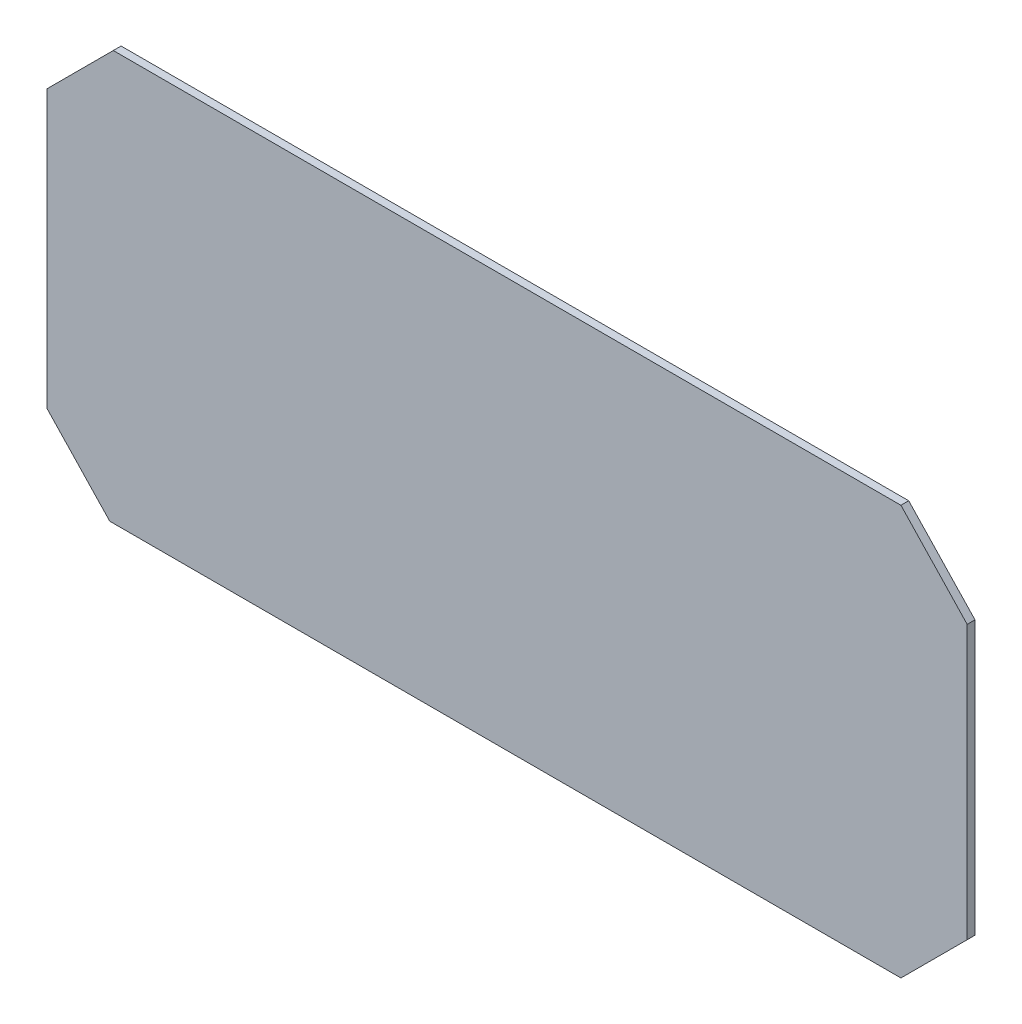
ISO-10303-21;
HEADER;
FILE_DESCRIPTION(('STEP AP214'),'2;1');
FILE_NAME('part.step','',(''),(''),'','','');
FILE_SCHEMA(('AUTOMOTIVE_DESIGN { 1 0 10303 214 1 1 1 1 }'));
ENDSEC;
DATA;
#1=APPLICATION_CONTEXT('core data for automotive mechanical design processes');
#2=APPLICATION_PROTOCOL_DEFINITION('international standard','automotive_design',2000,#1);
#3=PRODUCT_CONTEXT('',#1,'mechanical');
#4=PRODUCT('Part','Part','',(#3));
#5=PRODUCT_RELATED_PRODUCT_CATEGORY('part','',(#4));
#6=PRODUCT_DEFINITION_FORMATION('','',#4);
#7=PRODUCT_DEFINITION_CONTEXT('part definition',#1,'design');
#8=PRODUCT_DEFINITION('design','',#6,#7);
#9=PRODUCT_DEFINITION_SHAPE('','',#8);
#10=(LENGTH_UNIT() NAMED_UNIT(*) SI_UNIT(.MILLI.,.METRE.));
#11=(NAMED_UNIT(*) PLANE_ANGLE_UNIT() SI_UNIT($,.RADIAN.));
#12=(NAMED_UNIT(*) SI_UNIT($,.STERADIAN.) SOLID_ANGLE_UNIT());
#13=UNCERTAINTY_MEASURE_WITH_UNIT(LENGTH_MEASURE(1.E-05),#10,'distance_accuracy_value','');
#14=(GEOMETRIC_REPRESENTATION_CONTEXT(3) GLOBAL_UNCERTAINTY_ASSIGNED_CONTEXT((#13)) GLOBAL_UNIT_ASSIGNED_CONTEXT((#10,
#11,#12)) REPRESENTATION_CONTEXT('',''));
#15=CARTESIAN_POINT('',(0.,0.,0.));
#16=DIRECTION('',(0.,0.,1.));
#17=DIRECTION('',(1.,0.,0.));
#18=AXIS2_PLACEMENT_3D('',#15,#16,#17);
#19=CARTESIAN_POINT('',(17.,0.,2.));
#20=DIRECTION('',(0.707106781186547,-0.707106781186548,0.));
#21=DIRECTION('',(0.707106781186548,0.707106781186547,0.));
#22=AXIS2_PLACEMENT_3D('',#19,#20,#21);
#23=PLANE('',#22);
#24=DIRECTION('',(-0.707106781186548,-0.707106781186547,0.));
#25=VECTOR('',#24,1.);
#26=CARTESIAN_POINT('',(17.,0.,0.));
#27=LINE('',#26,#25);
#28=CARTESIAN_POINT('',(17.,0.,0.));
#29=VERTEX_POINT('',#28);
#30=CARTESIAN_POINT('',(0.,-17.,0.));
#31=VERTEX_POINT('',#30);
#32=EDGE_CURVE('E128',#29,#31,#27,.T.);
#33=ORIENTED_EDGE('',*,*,#32,.T.);
#34=DIRECTION('',(0.,0.,-1.));
#35=VECTOR('',#34,1.);
#36=CARTESIAN_POINT('',(0.,-17.,2.));
#37=LINE('',#36,#35);
#38=CARTESIAN_POINT('',(0.,-17.,2.));
#39=VERTEX_POINT('',#38);
#40=EDGE_CURVE('E11',#39,#31,#37,.T.);
#41=ORIENTED_EDGE('',*,*,#40,.F.);
#42=DIRECTION('',(-0.707106781186548,-0.707106781186547,0.));
#43=VECTOR('',#42,1.);
#44=CARTESIAN_POINT('',(17.,0.,2.));
#45=LINE('',#44,#43);
#46=CARTESIAN_POINT('',(17.,0.,2.));
#47=VERTEX_POINT('',#46);
#48=EDGE_CURVE('E142',#47,#39,#45,.T.);
#49=ORIENTED_EDGE('',*,*,#48,.F.);
#50=DIRECTION('',(0.,0.,-1.));
#51=VECTOR('',#50,1.);
#52=CARTESIAN_POINT('',(17.,0.,2.));
#53=LINE('',#52,#51);
#54=EDGE_CURVE('E124',#47,#29,#53,.T.);
#55=ORIENTED_EDGE('',*,*,#54,.T.);
#56=EDGE_LOOP('',(#33,#41,#49,#55));
#57=FACE_BOUND('',#56,.T.);
#58=ADVANCED_FACE('F32',(#57),#23,.F.);
#59=CARTESIAN_POINT('',(0.,-17.,2.));
#60=DIRECTION('',(1.,0.,0.));
#61=DIRECTION('',(0.,1.,0.));
#62=AXIS2_PLACEMENT_3D('',#59,#60,#61);
#63=PLANE('',#62);
#64=DIRECTION('',(0.,-1.,0.));
#65=VECTOR('',#64,1.);
#66=CARTESIAN_POINT('',(0.,-17.,0.));
#67=LINE('',#66,#65);
#68=CARTESIAN_POINT('',(0.,-88.,0.));
#69=VERTEX_POINT('',#68);
#70=EDGE_CURVE('E131',#31,#69,#67,.T.);
#71=ORIENTED_EDGE('',*,*,#70,.T.);
#72=DIRECTION('',(0.,0.,-1.));
#73=VECTOR('',#72,1.);
#74=CARTESIAN_POINT('',(0.,-88.,2.));
#75=LINE('',#74,#73);
#76=CARTESIAN_POINT('',(0.,-88.,2.));
#77=VERTEX_POINT('',#76);
#78=EDGE_CURVE('E40',#77,#69,#75,.T.);
#79=ORIENTED_EDGE('',*,*,#78,.F.);
#80=DIRECTION('',(0.,-1.,0.));
#81=VECTOR('',#80,1.);
#82=CARTESIAN_POINT('',(0.,-17.,2.));
#83=LINE('',#82,#81);
#84=EDGE_CURVE('E91',#39,#77,#83,.T.);
#85=ORIENTED_EDGE('',*,*,#84,.F.);
#86=ORIENTED_EDGE('',*,*,#40,.T.);
#87=EDGE_LOOP('',(#71,#79,#85,#86));
#88=FACE_BOUND('',#87,.T.);
#89=ADVANCED_FACE('F177',(#88),#63,.F.);
#90=CARTESIAN_POINT('',(0.,-88.,2.));
#91=DIRECTION('',(0.726208612382492,0.687474400469934,0.));
#92=DIRECTION('',(-0.687474400469934,0.726208612382492,0.));
#93=AXIS2_PLACEMENT_3D('',#90,#91,#92);
#94=PLANE('',#93);
#95=DIRECTION('',(0.687474400469934,-0.726208612382492,0.));
#96=VECTOR('',#95,1.);
#97=CARTESIAN_POINT('',(0.,-88.,0.));
#98=LINE('',#97,#96);
#99=CARTESIAN_POINT('',(16.0932610942837,-105.,0.));
#100=VERTEX_POINT('',#99);
#101=EDGE_CURVE('E133',#69,#100,#98,.T.);
#102=ORIENTED_EDGE('',*,*,#101,.T.);
#103=DIRECTION('',(0.,0.,-1.));
#104=VECTOR('',#103,1.);
#105=CARTESIAN_POINT('',(16.0932610942837,-105.,2.));
#106=LINE('',#105,#104);
#107=CARTESIAN_POINT('',(16.0932610942837,-105.,2.));
#108=VERTEX_POINT('',#107);
#109=EDGE_CURVE('E149',#108,#100,#106,.T.);
#110=ORIENTED_EDGE('',*,*,#109,.F.);
#111=DIRECTION('',(0.687474400469934,-0.726208612382492,0.));
#112=VECTOR('',#111,1.);
#113=CARTESIAN_POINT('',(0.,-88.,2.));
#114=LINE('',#113,#112);
#115=EDGE_CURVE('E157',#77,#108,#114,.T.);
#116=ORIENTED_EDGE('',*,*,#115,.F.);
#117=ORIENTED_EDGE('',*,*,#78,.T.);
#118=EDGE_LOOP('',(#102,#110,#116,#117));
#119=FACE_BOUND('',#118,.T.);
#120=ADVANCED_FACE('F155',(#119),#94,.F.);
#121=CARTESIAN_POINT('',(16.0932610942837,-105.,2.));
#122=DIRECTION('',(0.,1.,0.));
#123=DIRECTION('',(0.,0.,1.));
#124=AXIS2_PLACEMENT_3D('',#121,#122,#123);
#125=PLANE('',#124);
#126=DIRECTION('',(1.,0.,0.));
#127=VECTOR('',#126,1.);
#128=CARTESIAN_POINT('',(16.0932610942837,-105.,0.));
#129=LINE('',#128,#127);
#130=CARTESIAN_POINT('',(219.,-105.,0.));
#131=VERTEX_POINT('',#130);
#132=EDGE_CURVE('E135',#100,#131,#129,.T.);
#133=ORIENTED_EDGE('',*,*,#132,.T.);
#134=DIRECTION('',(0.,0.,-1.));
#135=VECTOR('',#134,1.);
#136=CARTESIAN_POINT('',(219.,-105.,2.));
#137=LINE('',#136,#135);
#138=CARTESIAN_POINT('',(219.,-105.,2.));
#139=VERTEX_POINT('',#138);
#140=EDGE_CURVE('E146',#139,#131,#137,.T.);
#141=ORIENTED_EDGE('',*,*,#140,.F.);
#142=DIRECTION('',(1.,0.,0.));
#143=VECTOR('',#142,1.);
#144=CARTESIAN_POINT('',(16.0932610942837,-105.,2.));
#145=LINE('',#144,#143);
#146=EDGE_CURVE('E169',#108,#139,#145,.T.);
#147=ORIENTED_EDGE('',*,*,#146,.F.);
#148=ORIENTED_EDGE('',*,*,#109,.T.);
#149=EDGE_LOOP('',(#133,#141,#147,#148));
#150=FACE_BOUND('',#149,.T.);
#151=ADVANCED_FACE('F165',(#150),#125,.F.);
#152=CARTESIAN_POINT('',(219.,-105.,2.));
#153=DIRECTION('',(-0.707106781186547,0.707106781186548,0.));
#154=DIRECTION('',(-0.707106781186548,-0.707106781186547,0.));
#155=AXIS2_PLACEMENT_3D('',#152,#153,#154);
#156=PLANE('',#155);
#157=DIRECTION('',(0.707106781186548,0.707106781186547,0.));
#158=VECTOR('',#157,1.);
#159=CARTESIAN_POINT('',(219.,-105.,0.));
#160=LINE('',#159,#158);
#161=CARTESIAN_POINT('',(236.,-88.,0.));
#162=VERTEX_POINT('',#161);
#163=EDGE_CURVE('E137',#131,#162,#160,.T.);
#164=ORIENTED_EDGE('',*,*,#163,.T.);
#165=DIRECTION('',(0.,0.,-1.));
#166=VECTOR('',#165,1.);
#167=CARTESIAN_POINT('',(236.,-88.,2.));
#168=LINE('',#167,#166);
#169=CARTESIAN_POINT('',(236.,-88.,2.));
#170=VERTEX_POINT('',#169);
#171=EDGE_CURVE('E119',#170,#162,#168,.T.);
#172=ORIENTED_EDGE('',*,*,#171,.F.);
#173=DIRECTION('',(0.707106781186548,0.707106781186547,0.));
#174=VECTOR('',#173,1.);
#175=CARTESIAN_POINT('',(219.,-105.,2.));
#176=LINE('',#175,#174);
#177=EDGE_CURVE('E110',#139,#170,#176,.T.);
#178=ORIENTED_EDGE('',*,*,#177,.F.);
#179=ORIENTED_EDGE('',*,*,#140,.T.);
#180=EDGE_LOOP('',(#164,#172,#178,#179));
#181=FACE_BOUND('',#180,.T.);
#182=ADVANCED_FACE('F168',(#181),#156,.F.);
#183=CARTESIAN_POINT('',(236.,-88.,2.));
#184=DIRECTION('',(-1.,0.,0.));
#185=DIRECTION('',(0.,0.,1.));
#186=AXIS2_PLACEMENT_3D('',#183,#184,#185);
#187=PLANE('',#186);
#188=DIRECTION('',(0.,1.,0.));
#189=VECTOR('',#188,1.);
#190=CARTESIAN_POINT('',(236.,-88.,0.));
#191=LINE('',#190,#189);
#192=CARTESIAN_POINT('',(236.,-17.9578270871808,0.));
#193=VERTEX_POINT('',#192);
#194=EDGE_CURVE('E118',#162,#193,#191,.T.);
#195=ORIENTED_EDGE('',*,*,#194,.T.);
#196=DIRECTION('',(0.,0.,-1.));
#197=VECTOR('',#196,1.);
#198=CARTESIAN_POINT('',(236.,-17.9578270871808,2.));
#199=LINE('',#198,#197);
#200=CARTESIAN_POINT('',(236.,-17.9578270871808,2.));
#201=VERTEX_POINT('',#200);
#202=EDGE_CURVE('E115',#201,#193,#199,.T.);
#203=ORIENTED_EDGE('',*,*,#202,.F.);
#204=DIRECTION('',(0.,1.,0.));
#205=VECTOR('',#204,1.);
#206=CARTESIAN_POINT('',(236.,-88.,2.));
#207=LINE('',#206,#205);
#208=EDGE_CURVE('E104',#170,#201,#207,.T.);
#209=ORIENTED_EDGE('',*,*,#208,.F.);
#210=ORIENTED_EDGE('',*,*,#171,.T.);
#211=EDGE_LOOP('',(#195,#203,#209,#210));
#212=FACE_BOUND('',#211,.T.);
#213=ADVANCED_FACE('F116',(#212),#187,.F.);
#214=CARTESIAN_POINT('',(236.,-17.9578270871808,2.));
#215=DIRECTION('',(-0.726208612382492,-0.687474400469934,0.));
#216=DIRECTION('',(0.687474400469934,-0.726208612382492,0.));
#217=AXIS2_PLACEMENT_3D('',#214,#215,#216);
#218=PLANE('',#217);
#219=DIRECTION('',(-0.687474400469934,0.726208612382492,0.));
#220=VECTOR('',#219,1.);
#221=CARTESIAN_POINT('',(236.,-17.9578270871808,0.));
#222=LINE('',#221,#220);
#223=CARTESIAN_POINT('',(219.,0.,0.));
#224=VERTEX_POINT('',#223);
#225=EDGE_CURVE('E77',#193,#224,#222,.T.);
#226=ORIENTED_EDGE('',*,*,#225,.T.);
#227=DIRECTION('',(0.,0.,-1.));
#228=VECTOR('',#227,1.);
#229=CARTESIAN_POINT('',(219.,0.,2.));
#230=LINE('',#229,#228);
#231=CARTESIAN_POINT('',(219.,0.,2.));
#232=VERTEX_POINT('',#231);
#233=EDGE_CURVE('E120',#232,#224,#230,.T.);
#234=ORIENTED_EDGE('',*,*,#233,.F.);
#235=DIRECTION('',(-0.687474400469934,0.726208612382492,0.));
#236=VECTOR('',#235,1.);
#237=CARTESIAN_POINT('',(236.,-17.9578270871808,2.));
#238=LINE('',#237,#236);
#239=EDGE_CURVE('E108',#201,#232,#238,.T.);
#240=ORIENTED_EDGE('',*,*,#239,.F.);
#241=ORIENTED_EDGE('',*,*,#202,.T.);
#242=EDGE_LOOP('',(#226,#234,#240,#241));
#243=FACE_BOUND('',#242,.T.);
#244=ADVANCED_FACE('F122',(#243),#218,.F.);
#245=CARTESIAN_POINT('',(219.,0.,2.));
#246=DIRECTION('',(0.,-1.,0.));
#247=DIRECTION('',(1.,0.,0.));
#248=AXIS2_PLACEMENT_3D('',#245,#246,#247);
#249=PLANE('',#248);
#250=DIRECTION('',(-1.,0.,0.));
#251=VECTOR('',#250,1.);
#252=CARTESIAN_POINT('',(219.,0.,0.));
#253=LINE('',#252,#251);
#254=EDGE_CURVE('E83',#224,#29,#253,.T.);
#255=ORIENTED_EDGE('',*,*,#254,.T.);
#256=ORIENTED_EDGE('',*,*,#54,.F.);
#257=DIRECTION('',(-1.,0.,0.));
#258=VECTOR('',#257,1.);
#259=CARTESIAN_POINT('',(219.,0.,2.));
#260=LINE('',#259,#258);
#261=EDGE_CURVE('E48',#232,#47,#260,.T.);
#262=ORIENTED_EDGE('',*,*,#261,.F.);
#263=ORIENTED_EDGE('',*,*,#233,.T.);
#264=EDGE_LOOP('',(#255,#256,#262,#263));
#265=FACE_BOUND('',#264,.T.);
#266=ADVANCED_FACE('F193',(#265),#249,.F.);
#267=CARTESIAN_POINT('',(0.,0.,2.));
#268=DIRECTION('',(0.,0.,1.));
#269=DIRECTION('',(1.,0.,0.));
#270=AXIS2_PLACEMENT_3D('',#267,#268,#269);
#271=PLANE('',#270);
#272=ORIENTED_EDGE('',*,*,#48,.T.);
#273=ORIENTED_EDGE('',*,*,#84,.T.);
#274=ORIENTED_EDGE('',*,*,#115,.T.);
#275=ORIENTED_EDGE('',*,*,#146,.T.);
#276=ORIENTED_EDGE('',*,*,#177,.T.);
#277=ORIENTED_EDGE('',*,*,#208,.T.);
#278=ORIENTED_EDGE('',*,*,#239,.T.);
#279=ORIENTED_EDGE('',*,*,#261,.T.);
#280=EDGE_LOOP('',(#272,#273,#274,#275,#276,#277,#278,#279));
#281=FACE_BOUND('',#280,.T.);
#282=ADVANCED_FACE('F106',(#281),#271,.T.);
#283=CARTESIAN_POINT('',(0.,0.,0.));
#284=DIRECTION('',(0.,0.,1.));
#285=DIRECTION('',(1.,0.,0.));
#286=AXIS2_PLACEMENT_3D('',#283,#284,#285);
#287=PLANE('',#286);
#288=ORIENTED_EDGE('',*,*,#32,.F.);
#289=ORIENTED_EDGE('',*,*,#254,.F.);
#290=ORIENTED_EDGE('',*,*,#225,.F.);
#291=ORIENTED_EDGE('',*,*,#194,.F.);
#292=ORIENTED_EDGE('',*,*,#163,.F.);
#293=ORIENTED_EDGE('',*,*,#132,.F.);
#294=ORIENTED_EDGE('',*,*,#101,.F.);
#295=ORIENTED_EDGE('',*,*,#70,.F.);
#296=EDGE_LOOP('',(#288,#289,#290,#291,#292,#293,#294,#295));
#297=FACE_BOUND('',#296,.T.);
#298=ADVANCED_FACE('F161',(#297),#287,.F.);
#299=CLOSED_SHELL('',(#58,#89,#120,#151,#182,#213,#244,#266,#282,#298));
#300=MANIFOLD_SOLID_BREP('B2',#299);
#301=ADVANCED_BREP_SHAPE_REPRESENTATION('',(#18,#300),#14);
#302=SHAPE_DEFINITION_REPRESENTATION(#9,#301);
ENDSEC;
END-ISO-10303-21;
